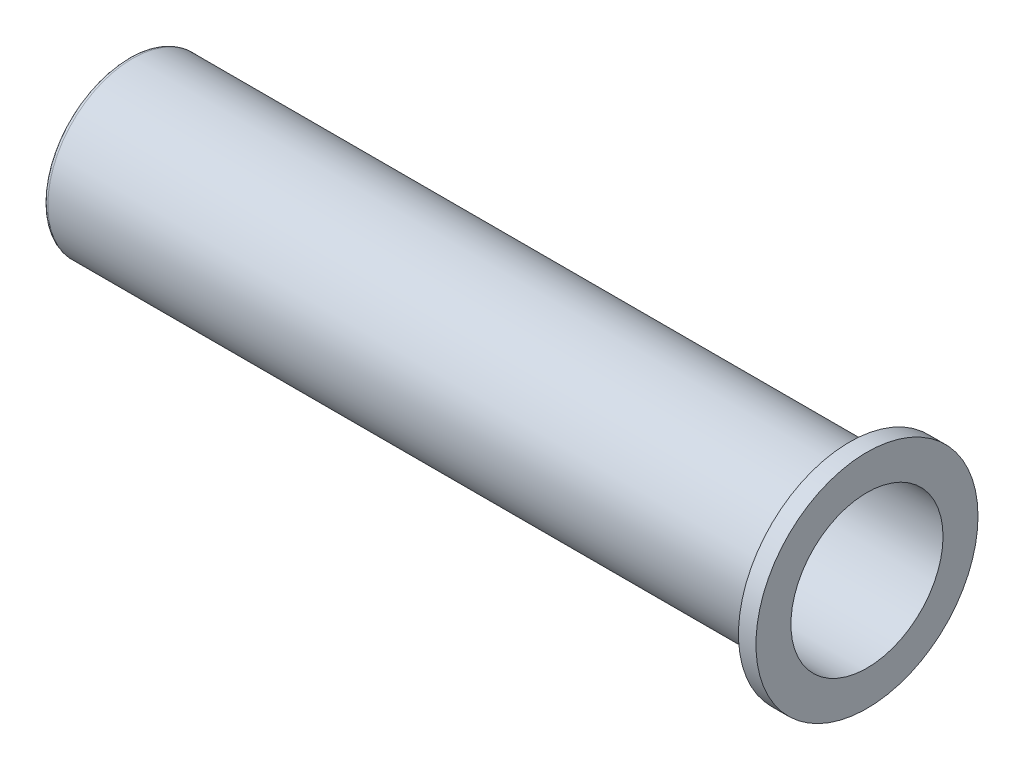
ISO-10303-21;
HEADER;
FILE_DESCRIPTION(('STEP AP214'),'2;1');
FILE_NAME('part.step','',(''),(''),'','','');
FILE_SCHEMA(('AUTOMOTIVE_DESIGN { 1 0 10303 214 1 1 1 1 }'));
ENDSEC;
DATA;
#1=APPLICATION_CONTEXT('core data for automotive mechanical design processes');
#2=APPLICATION_PROTOCOL_DEFINITION('international standard','automotive_design',2000,#1);
#3=PRODUCT_CONTEXT('',#1,'mechanical');
#4=PRODUCT('Part','Part','',(#3));
#5=PRODUCT_RELATED_PRODUCT_CATEGORY('part','',(#4));
#6=PRODUCT_DEFINITION_FORMATION('','',#4);
#7=PRODUCT_DEFINITION_CONTEXT('part definition',#1,'design');
#8=PRODUCT_DEFINITION('design','',#6,#7);
#9=PRODUCT_DEFINITION_SHAPE('','',#8);
#10=(LENGTH_UNIT() NAMED_UNIT(*) SI_UNIT(.MILLI.,.METRE.));
#11=(NAMED_UNIT(*) PLANE_ANGLE_UNIT() SI_UNIT($,.RADIAN.));
#12=(NAMED_UNIT(*) SI_UNIT($,.STERADIAN.) SOLID_ANGLE_UNIT());
#13=UNCERTAINTY_MEASURE_WITH_UNIT(LENGTH_MEASURE(1.E-05),#10,'distance_accuracy_value','');
#14=(GEOMETRIC_REPRESENTATION_CONTEXT(3) GLOBAL_UNCERTAINTY_ASSIGNED_CONTEXT((#13)) GLOBAL_UNIT_ASSIGNED_CONTEXT((#10,
#11,#12)) REPRESENTATION_CONTEXT('',''));
#15=CARTESIAN_POINT('',(0.,0.,0.));
#16=DIRECTION('',(0.,0.,1.));
#17=DIRECTION('',(1.,0.,0.));
#18=AXIS2_PLACEMENT_3D('',#15,#16,#17);
#19=CARTESIAN_POINT('',(5.75,0.,-4.85));
#20=DIRECTION('',(-1.,0.,0.));
#21=DIRECTION('',(0.,0.,1.));
#22=AXIS2_PLACEMENT_3D('',#19,#20,#21);
#23=PLANE('',#22);
#24=CARTESIAN_POINT('',(5.75,0.,0.));
#25=DIRECTION('',(1.,0.,0.));
#26=DIRECTION('',(0.,0.,-1.));
#27=AXIS2_PLACEMENT_3D('',#24,#25,#26);
#28=CIRCLE('',#27,4.85);
#29=CARTESIAN_POINT('',(5.75,0.,-4.85));
#30=VERTEX_POINT('',#29);
#31=EDGE_CURVE('E63',#30,#30,#28,.T.);
#32=ORIENTED_EDGE('',*,*,#31,.T.);
#33=EDGE_LOOP('',(#32));
#34=FACE_BOUND('',#33,.T.);
#35=CARTESIAN_POINT('',(5.75,0.,0.));
#36=DIRECTION('',(1.,0.,0.));
#37=DIRECTION('',(0.,0.,-1.));
#38=AXIS2_PLACEMENT_3D('',#35,#36,#37);
#39=CIRCLE('',#38,6.35);
#40=CARTESIAN_POINT('',(5.75,0.,-6.35));
#41=VERTEX_POINT('',#40);
#42=EDGE_CURVE('E54',#41,#41,#39,.T.);
#43=ORIENTED_EDGE('',*,*,#42,.F.);
#44=EDGE_LOOP('',(#43));
#45=FACE_BOUND('',#44,.T.);
#46=ADVANCED_FACE('F34',(#34,#45),#23,.T.);
#47=CARTESIAN_POINT('',(0.,0.,0.));
#48=DIRECTION('',(1.,0.,0.));
#49=DIRECTION('',(0.,0.,-1.));
#50=AXIS2_PLACEMENT_3D('',#47,#48,#49);
#51=CYLINDRICAL_SURFACE('',#50,6.35);
#52=ORIENTED_EDGE('',*,*,#42,.T.);
#53=EDGE_LOOP('',(#52));
#54=FACE_BOUND('',#53,.T.);
#55=CARTESIAN_POINT('',(6.75,0.,0.));
#56=DIRECTION('',(1.,0.,0.));
#57=DIRECTION('',(0.,0.,-1.));
#58=AXIS2_PLACEMENT_3D('',#55,#56,#57);
#59=CIRCLE('',#58,6.35);
#60=CARTESIAN_POINT('',(6.75,0.,-6.35));
#61=VERTEX_POINT('',#60);
#62=EDGE_CURVE('E57',#61,#61,#59,.T.);
#63=ORIENTED_EDGE('',*,*,#62,.F.);
#64=EDGE_LOOP('',(#63));
#65=FACE_BOUND('',#64,.T.);
#66=ADVANCED_FACE('F90',(#54,#65),#51,.T.);
#67=CARTESIAN_POINT('',(6.75,0.,-6.35));
#68=DIRECTION('',(1.,0.,0.));
#69=DIRECTION('',(0.,0.,-1.));
#70=AXIS2_PLACEMENT_3D('',#67,#68,#69);
#71=PLANE('',#70);
#72=ORIENTED_EDGE('',*,*,#62,.T.);
#73=EDGE_LOOP('',(#72));
#74=FACE_BOUND('',#73,.T.);
#75=CARTESIAN_POINT('',(6.75,0.,0.));
#76=DIRECTION('',(1.,0.,0.));
#77=DIRECTION('',(0.,0.,-1.));
#78=AXIS2_PLACEMENT_3D('',#75,#76,#77);
#79=CIRCLE('',#78,4.35);
#80=CARTESIAN_POINT('',(6.75,0.,-4.35));
#81=VERTEX_POINT('',#80);
#82=EDGE_CURVE('E60',#81,#81,#79,.T.);
#83=ORIENTED_EDGE('',*,*,#82,.F.);
#84=EDGE_LOOP('',(#83));
#85=FACE_BOUND('',#84,.T.);
#86=ADVANCED_FACE('F96',(#74,#85),#71,.T.);
#87=CARTESIAN_POINT('',(0.,0.,0.));
#88=DIRECTION('',(1.,0.,0.));
#89=DIRECTION('',(0.,0.,-1.));
#90=AXIS2_PLACEMENT_3D('',#87,#88,#89);
#91=CYLINDRICAL_SURFACE('',#90,4.35);
#92=CARTESIAN_POINT('',(-34.75,0.,0.));
#93=DIRECTION('',(-1.,0.,0.));
#94=DIRECTION('',(0.,0.,1.));
#95=AXIS2_PLACEMENT_3D('',#92,#93,#94);
#96=CIRCLE('',#95,4.35);
#97=CARTESIAN_POINT('',(-34.75,0.,4.35));
#98=VERTEX_POINT('',#97);
#99=EDGE_CURVE('E45',#98,#98,#96,.T.);
#100=ORIENTED_EDGE('',*,*,#99,.T.);
#101=EDGE_LOOP('',(#100));
#102=FACE_BOUND('',#101,.T.);
#103=ORIENTED_EDGE('',*,*,#82,.T.);
#104=EDGE_LOOP('',(#103));
#105=FACE_BOUND('',#104,.T.);
#106=ADVANCED_FACE('F113',(#102,#105),#91,.F.);
#107=CARTESIAN_POINT('',(0.,0.,0.));
#108=DIRECTION('',(1.,0.,0.));
#109=DIRECTION('',(0.,0.,-1.));
#110=AXIS2_PLACEMENT_3D('',#107,#108,#109);
#111=CYLINDRICAL_SURFACE('',#110,4.85);
#112=CARTESIAN_POINT('',(-35.25,0.,0.));
#113=DIRECTION('',(-1.,0.,0.));
#114=DIRECTION('',(0.,0.,1.));
#115=AXIS2_PLACEMENT_3D('',#112,#113,#114);
#116=CIRCLE('',#115,4.85);
#117=CARTESIAN_POINT('',(-35.25,0.,4.85));
#118=VERTEX_POINT('',#117);
#119=EDGE_CURVE('E10',#118,#118,#116,.F.);
#120=ORIENTED_EDGE('',*,*,#119,.T.);
#121=EDGE_LOOP('',(#120));
#122=FACE_BOUND('',#121,.T.);
#123=ORIENTED_EDGE('',*,*,#31,.F.);
#124=EDGE_LOOP('',(#123));
#125=FACE_BOUND('',#124,.T.);
#126=ADVANCED_FACE('F86',(#122,#125),#111,.T.);
#127=CARTESIAN_POINT('',(-35.,0.,0.));
#128=DIRECTION('',(-1.,0.,0.));
#129=DIRECTION('',(0.,0.,1.));
#130=AXIS2_PLACEMENT_3D('',#127,#128,#129);
#131=PLANE('',#130);
#132=CARTESIAN_POINT('',(-35.,0.,0.));
#133=DIRECTION('',(-1.,0.,0.));
#134=DIRECTION('',(0.,0.,1.));
#135=AXIS2_PLACEMENT_3D('',#132,#133,#134);
#136=CIRCLE('',#135,4.1);
#137=CARTESIAN_POINT('',(-35.,0.,4.1));
#138=VERTEX_POINT('',#137);
#139=EDGE_CURVE('E49',#138,#138,#136,.F.);
#140=ORIENTED_EDGE('',*,*,#139,.T.);
#141=EDGE_LOOP('',(#140));
#142=FACE_BOUND('',#141,.T.);
#143=CARTESIAN_POINT('',(-35.,0.,0.));
#144=DIRECTION('',(-1.,0.,0.));
#145=DIRECTION('',(0.,0.,1.));
#146=AXIS2_PLACEMENT_3D('',#143,#144,#145);
#147=CIRCLE('',#146,2.75);
#148=CARTESIAN_POINT('',(-35.,0.,2.75));
#149=VERTEX_POINT('',#148);
#150=EDGE_CURVE('E67',#149,#149,#147,.T.);
#151=ORIENTED_EDGE('',*,*,#150,.T.);
#152=EDGE_LOOP('',(#151));
#153=FACE_BOUND('',#152,.T.);
#154=ADVANCED_FACE('F78',(#142,#153),#131,.F.);
#155=CARTESIAN_POINT('',(-35.5,0.,0.));
#156=DIRECTION('',(-1.,0.,0.));
#157=DIRECTION('',(0.,0.,1.));
#158=AXIS2_PLACEMENT_3D('',#155,#156,#157);
#159=PLANE('',#158);
#160=CARTESIAN_POINT('',(-35.5,0.,0.));
#161=DIRECTION('',(-1.,0.,0.));
#162=DIRECTION('',(0.,0.,1.));
#163=AXIS2_PLACEMENT_3D('',#160,#161,#162);
#164=CIRCLE('',#163,4.59999999999999);
#165=CARTESIAN_POINT('',(-35.5,0.,4.59999999999999));
#166=VERTEX_POINT('',#165);
#167=EDGE_CURVE('E41',#166,#166,#164,.T.);
#168=ORIENTED_EDGE('',*,*,#167,.T.);
#169=EDGE_LOOP('',(#168));
#170=FACE_BOUND('',#169,.T.);
#171=CARTESIAN_POINT('',(-35.5,0.,0.));
#172=DIRECTION('',(-1.,0.,0.));
#173=DIRECTION('',(0.,0.,1.));
#174=AXIS2_PLACEMENT_3D('',#171,#172,#173);
#175=CIRCLE('',#174,2.75);
#176=CARTESIAN_POINT('',(-35.5,0.,2.75));
#177=VERTEX_POINT('',#176);
#178=EDGE_CURVE('E66',#177,#177,#175,.T.);
#179=ORIENTED_EDGE('',*,*,#178,.F.);
#180=EDGE_LOOP('',(#179));
#181=FACE_BOUND('',#180,.T.);
#182=ADVANCED_FACE('F76',(#170,#181),#159,.T.);
#183=CARTESIAN_POINT('',(-35.5,0.,0.));
#184=DIRECTION('',(1.,0.,0.));
#185=DIRECTION('',(0.,0.,-1.));
#186=AXIS2_PLACEMENT_3D('',#183,#184,#185);
#187=CYLINDRICAL_SURFACE('',#186,2.75);
#188=ORIENTED_EDGE('',*,*,#178,.T.);
#189=EDGE_LOOP('',(#188));
#190=FACE_BOUND('',#189,.T.);
#191=ORIENTED_EDGE('',*,*,#150,.F.);
#192=EDGE_LOOP('',(#191));
#193=FACE_BOUND('',#192,.T.);
#194=ADVANCED_FACE('F73',(#190,#193),#187,.F.);
#195=CARTESIAN_POINT('',(-34.75,0.,0.));
#196=DIRECTION('',(-1.,0.,0.));
#197=DIRECTION('',(0.,0.,1.));
#198=AXIS2_PLACEMENT_3D('',#195,#196,#197);
#199=TOROIDAL_SURFACE('',#198,4.1,0.25);
#200=ORIENTED_EDGE('',*,*,#99,.F.);
#201=EDGE_LOOP('',(#200));
#202=FACE_BOUND('',#201,.T.);
#203=ORIENTED_EDGE('',*,*,#139,.F.);
#204=EDGE_LOOP('',(#203));
#205=FACE_BOUND('',#204,.T.);
#206=ADVANCED_FACE('F84',(#202,#205),#199,.F.);
#207=CARTESIAN_POINT('',(-35.25,0.,0.));
#208=DIRECTION('',(-1.,0.,0.));
#209=DIRECTION('',(0.,0.,1.));
#210=AXIS2_PLACEMENT_3D('',#207,#208,#209);
#211=TOROIDAL_SURFACE('',#210,4.59999999999999,0.25);
#212=ORIENTED_EDGE('',*,*,#119,.F.);
#213=EDGE_LOOP('',(#212));
#214=FACE_BOUND('',#213,.T.);
#215=ORIENTED_EDGE('',*,*,#167,.F.);
#216=EDGE_LOOP('',(#215));
#217=FACE_BOUND('',#216,.T.);
#218=ADVANCED_FACE('F36',(#214,#217),#211,.T.);
#219=CLOSED_SHELL('',(#46,#66,#86,#106,#126,#154,#182,#194,#206,#218));
#220=MANIFOLD_SOLID_BREP('B2',#219);
#221=ADVANCED_BREP_SHAPE_REPRESENTATION('',(#18,#220),#14);
#222=SHAPE_DEFINITION_REPRESENTATION(#9,#221);
ENDSEC;
END-ISO-10303-21;
